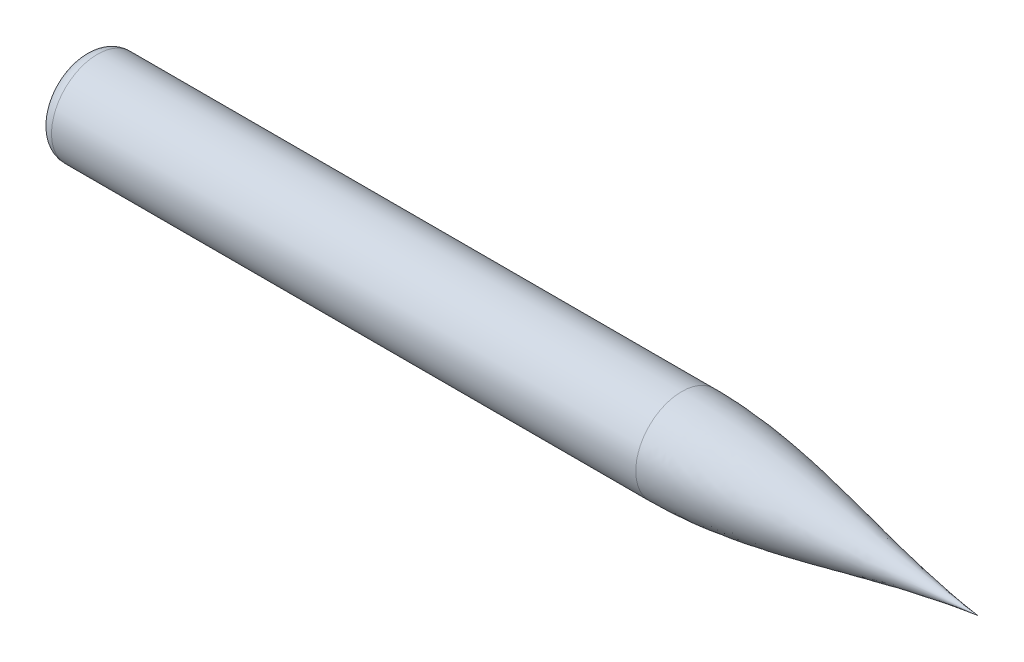
ISO-10303-21;
HEADER;
FILE_DESCRIPTION(('STEP AP214'),'2;1');
FILE_NAME('part.step','',(''),(''),'','','');
FILE_SCHEMA(('AUTOMOTIVE_DESIGN { 1 0 10303 214 1 1 1 1 }'));
ENDSEC;
DATA;
#1=APPLICATION_CONTEXT('core data for automotive mechanical design processes');
#2=APPLICATION_PROTOCOL_DEFINITION('international standard','automotive_design',2000,#1);
#3=PRODUCT_CONTEXT('',#1,'mechanical');
#4=PRODUCT('Part','Part','',(#3));
#5=PRODUCT_RELATED_PRODUCT_CATEGORY('part','',(#4));
#6=PRODUCT_DEFINITION_FORMATION('','',#4);
#7=PRODUCT_DEFINITION_CONTEXT('part definition',#1,'design');
#8=PRODUCT_DEFINITION('design','',#6,#7);
#9=PRODUCT_DEFINITION_SHAPE('','',#8);
#10=(LENGTH_UNIT() NAMED_UNIT(*) SI_UNIT(.MILLI.,.METRE.));
#11=(NAMED_UNIT(*) PLANE_ANGLE_UNIT() SI_UNIT($,.RADIAN.));
#12=(NAMED_UNIT(*) SI_UNIT($,.STERADIAN.) SOLID_ANGLE_UNIT());
#13=UNCERTAINTY_MEASURE_WITH_UNIT(LENGTH_MEASURE(1.E-05),#10,'distance_accuracy_value','');
#14=(GEOMETRIC_REPRESENTATION_CONTEXT(3) GLOBAL_UNCERTAINTY_ASSIGNED_CONTEXT((#13)) GLOBAL_UNIT_ASSIGNED_CONTEXT((#10,
#11,#12)) REPRESENTATION_CONTEXT('',''));
#15=CARTESIAN_POINT('',(0.,0.,0.));
#16=DIRECTION('',(0.,0.,1.));
#17=DIRECTION('',(1.,0.,0.));
#18=AXIS2_PLACEMENT_3D('',#15,#16,#17);
#19=CARTESIAN_POINT('',(-12733.4609863901,19794.2385547825,0.));
#20=CARTESIAN_POINT('',(-13107.2259746355,19836.1051127443,0.));
#21=CARTESIAN_POINT('',(-13455.0479162904,19963.7730711511,0.));
#22=CARTESIAN_POINT('',(-13822.3343100868,19962.9247072799,0.));
#23=B_SPLINE_CURVE_WITH_KNOTS('',3,(#19,#20,#21,#22),.UNSPECIFIED.,.F.,.F.,(4,4),(0.,1.),.UNSPECIFIED.);
#24=CARTESIAN_POINT('',(-12733.4609863901,19794.2385547825,0.));
#25=DIRECTION('',(1.,0.,0.));
#26=AXIS1_PLACEMENT('',#24,#25);
#27=SURFACE_OF_REVOLUTION('',#23,#26);
#28=CARTESIAN_POINT('',(-13822.3343100868,19794.2385547825,0.));
#29=DIRECTION('',(1.,0.,0.));
#30=DIRECTION('',(0.,0.,-1.));
#31=AXIS2_PLACEMENT_3D('',#28,#29,#30);
#32=CIRCLE('',#31,168.686152497393);
#33=CARTESIAN_POINT('',(-13822.3343100868,19794.2385547825,-168.686152497393));
#34=VERTEX_POINT('',#33);
#35=EDGE_CURVE('E11',#34,#34,#32,.T.);
#36=ORIENTED_EDGE('',*,*,#35,.T.);
#37=EDGE_LOOP('',(#36));
#38=FACE_BOUND('',#37,.T.);
#39=CARTESIAN_POINT('',(-12733.4609863901,19794.2385547825,0.));
#40=VERTEX_POINT('',#39);
#41=VERTEX_LOOP('',#40);
#42=FACE_BOUND('',#41,.T.);
#43=ADVANCED_FACE('F39',(#38,#42),#27,.F.);
#44=CARTESIAN_POINT('',(-12733.4609863901,19794.2385547825,0.));
#45=DIRECTION('',(1.,0.,0.));
#46=DIRECTION('',(0.,0.,-1.));
#47=AXIS2_PLACEMENT_3D('',#44,#45,#46);
#48=CYLINDRICAL_SURFACE('',#47,168.686152497393);
#49=CARTESIAN_POINT('',(-15969.1606748308,19794.2385547825,0.));
#50=DIRECTION('',(1.,0.,0.));
#51=DIRECTION('',(0.,0.,-1.));
#52=AXIS2_PLACEMENT_3D('',#49,#50,#51);
#53=CIRCLE('',#52,168.686152497393);
#54=CARTESIAN_POINT('',(-15969.1606748308,19794.2385547825,-168.686152497393));
#55=VERTEX_POINT('',#54);
#56=EDGE_CURVE('E46',#55,#55,#53,.T.);
#57=ORIENTED_EDGE('',*,*,#56,.T.);
#58=EDGE_LOOP('',(#57));
#59=FACE_BOUND('',#58,.T.);
#60=ORIENTED_EDGE('',*,*,#35,.F.);
#61=EDGE_LOOP('',(#60));
#62=FACE_BOUND('',#61,.T.);
#63=ADVANCED_FACE('F50',(#59,#62),#48,.T.);
#64=CARTESIAN_POINT('',(-15969.1606748308,19794.2385547825,0.));
#65=DIRECTION('',(1.,0.,0.));
#66=DIRECTION('',(0.,0.,-1.));
#67=AXIS2_PLACEMENT_3D('',#64,#65,#66);
#68=TOROIDAL_SURFACE('',#67,118.686152497393,50.0000000000007);
#69=CARTESIAN_POINT('',(-16019.1606748308,19794.2385547825,0.));
#70=DIRECTION('',(1.,0.,0.));
#71=DIRECTION('',(0.,0.,-1.));
#72=AXIS2_PLACEMENT_3D('',#69,#70,#71);
#73=CIRCLE('',#72,118.686152497393);
#74=CARTESIAN_POINT('',(-16019.1606748308,19794.2385547825,-118.686152497393));
#75=VERTEX_POINT('',#74);
#76=EDGE_CURVE('E73',#75,#75,#73,.T.);
#77=ORIENTED_EDGE('',*,*,#76,.T.);
#78=EDGE_LOOP('',(#77));
#79=FACE_BOUND('',#78,.T.);
#80=ORIENTED_EDGE('',*,*,#56,.F.);
#81=EDGE_LOOP('',(#80));
#82=FACE_BOUND('',#81,.T.);
#83=ADVANCED_FACE('F55',(#79,#82),#68,.T.);
#84=CARTESIAN_POINT('',(-16019.1606748308,19794.2385547825,0.));
#85=DIRECTION('',(-1.,0.,0.));
#86=DIRECTION('',(0.,0.,1.));
#87=AXIS2_PLACEMENT_3D('',#84,#85,#86);
#88=PLANE('',#87);
#89=ORIENTED_EDGE('',*,*,#76,.F.);
#90=EDGE_LOOP('',(#89));
#91=FACE_BOUND('',#90,.T.);
#92=ADVANCED_FACE('F62',(#91),#88,.T.);
#93=CLOSED_SHELL('',(#43,#63,#83,#92));
#94=MANIFOLD_SOLID_BREP('B2',#93);
#95=ADVANCED_BREP_SHAPE_REPRESENTATION('',(#18,#94),#14);
#96=SHAPE_DEFINITION_REPRESENTATION(#9,#95);
ENDSEC;
END-ISO-10303-21;
